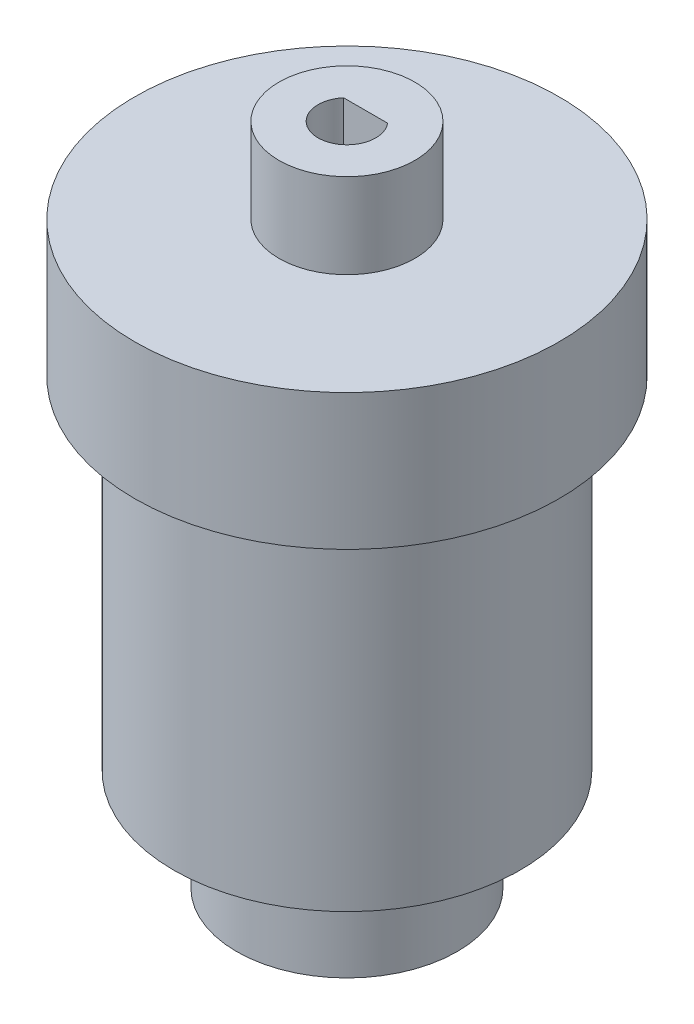
ISO-10303-21;
HEADER;
FILE_DESCRIPTION(('STEP AP214'),'2;1');
FILE_NAME('part.step','',(''),(''),'','','');
FILE_SCHEMA(('AUTOMOTIVE_DESIGN { 1 0 10303 214 1 1 1 1 }'));
ENDSEC;
DATA;
#1=APPLICATION_CONTEXT('core data for automotive mechanical design processes');
#2=APPLICATION_PROTOCOL_DEFINITION('international standard','automotive_design',2000,#1);
#3=PRODUCT_CONTEXT('',#1,'mechanical');
#4=PRODUCT('Part','Part','',(#3));
#5=PRODUCT_RELATED_PRODUCT_CATEGORY('part','',(#4));
#6=PRODUCT_DEFINITION_FORMATION('','',#4);
#7=PRODUCT_DEFINITION_CONTEXT('part definition',#1,'design');
#8=PRODUCT_DEFINITION('design','',#6,#7);
#9=PRODUCT_DEFINITION_SHAPE('','',#8);
#10=(LENGTH_UNIT() NAMED_UNIT(*) SI_UNIT(.MILLI.,.METRE.));
#11=(NAMED_UNIT(*) PLANE_ANGLE_UNIT() SI_UNIT($,.RADIAN.));
#12=(NAMED_UNIT(*) SI_UNIT($,.STERADIAN.) SOLID_ANGLE_UNIT());
#13=UNCERTAINTY_MEASURE_WITH_UNIT(LENGTH_MEASURE(1.E-05),#10,'distance_accuracy_value','');
#14=(GEOMETRIC_REPRESENTATION_CONTEXT(3) GLOBAL_UNCERTAINTY_ASSIGNED_CONTEXT((#13)) GLOBAL_UNIT_ASSIGNED_CONTEXT((#10,
#11,#12)) REPRESENTATION_CONTEXT('',''));
#15=CARTESIAN_POINT('',(0.,0.,0.));
#16=DIRECTION('',(0.,0.,1.));
#17=DIRECTION('',(1.,0.,0.));
#18=AXIS2_PLACEMENT_3D('',#15,#16,#17);
#19=CARTESIAN_POINT('',(0.,20.1,0.));
#20=DIRECTION('',(0.,-1.,0.));
#21=DIRECTION('',(0.,0.,-1.));
#22=AXIS2_PLACEMENT_3D('',#19,#20,#21);
#23=CYLINDRICAL_SURFACE('',#22,10.2);
#24=CARTESIAN_POINT('',(0.,20.1,0.));
#25=DIRECTION('',(0.,1.,0.));
#26=DIRECTION('',(0.,0.,1.));
#27=AXIS2_PLACEMENT_3D('',#24,#25,#26);
#28=CIRCLE('',#27,10.2);
#29=CARTESIAN_POINT('',(-5.03591292971732,20.1,-8.87015112409624));
#30=VERTEX_POINT('',#29);
#31=CARTESIAN_POINT('',(5.03591292971732,20.1,-8.87015112409624));
#32=VERTEX_POINT('',#31);
#33=EDGE_CURVE('E115',#30,#32,#28,.T.);
#34=ORIENTED_EDGE('',*,*,#33,.F.);
#35=DIRECTION('',(0.,1.,0.));
#36=VECTOR('',#35,1.);
#37=CARTESIAN_POINT('',(-5.03591292971732,0.,-8.87015112409624));
#38=LINE('',#37,#36);
#39=CARTESIAN_POINT('',(-5.03591292971732,0.,-8.87015112409624));
#40=VERTEX_POINT('',#39);
#41=EDGE_CURVE('E138',#40,#30,#38,.T.);
#42=ORIENTED_EDGE('',*,*,#41,.F.);
#43=CARTESIAN_POINT('',(0.,0.,0.));
#44=DIRECTION('',(0.,1.,0.));
#45=DIRECTION('',(0.,0.,1.));
#46=AXIS2_PLACEMENT_3D('',#43,#44,#45);
#47=CIRCLE('',#46,10.2);
#48=CARTESIAN_POINT('',(5.03591292971732,0.,-8.87015112409624));
#49=VERTEX_POINT('',#48);
#50=EDGE_CURVE('E36',#40,#49,#47,.T.);
#51=ORIENTED_EDGE('',*,*,#50,.T.);
#52=DIRECTION('',(0.,1.,0.));
#53=VECTOR('',#52,1.);
#54=CARTESIAN_POINT('',(5.03591292971732,0.,-8.87015112409624));
#55=LINE('',#54,#53);
#56=EDGE_CURVE('E141',#49,#32,#55,.T.);
#57=ORIENTED_EDGE('',*,*,#56,.T.);
#58=EDGE_LOOP('',(#34,#42,#51,#57));
#59=FACE_BOUND('',#58,.T.);
#60=ADVANCED_FACE('F33',(#59),#23,.T.);
#61=CARTESIAN_POINT('',(0.,0.,0.));
#62=DIRECTION('',(0.,1.,0.));
#63=DIRECTION('',(0.,0.,1.));
#64=AXIS2_PLACEMENT_3D('',#61,#62,#63);
#65=PLANE('',#64);
#66=CARTESIAN_POINT('',(0.,0.,0.));
#67=DIRECTION('',(0.,-1.,0.));
#68=DIRECTION('',(0.,0.,-1.));
#69=AXIS2_PLACEMENT_3D('',#66,#67,#68);
#70=CIRCLE('',#69,6.5);
#71=CARTESIAN_POINT('',(0.,0.,-6.5));
#72=VERTEX_POINT('',#71);
#73=EDGE_CURVE('E11',#72,#72,#70,.T.);
#74=ORIENTED_EDGE('',*,*,#73,.F.);
#75=EDGE_LOOP('',(#74));
#76=FACE_BOUND('',#75,.T.);
#77=ORIENTED_EDGE('',*,*,#50,.F.);
#78=DIRECTION('',(0.581861504610038,0.,0.813287888421402));
#79=VECTOR('',#78,1.);
#80=CARTESIAN_POINT('',(-3.6,0.,-6.86312610987151));
#81=LINE('',#80,#79);
#82=CARTESIAN_POINT('',(-3.6,0.,-6.86312610987151));
#83=VERTEX_POINT('',#82);
#84=EDGE_CURVE('E122',#40,#83,#81,.T.);
#85=ORIENTED_EDGE('',*,*,#84,.T.);
#86=DIRECTION('',(1.,0.,0.));
#87=VECTOR('',#86,1.);
#88=CARTESIAN_POINT('',(-3.6,0.,-6.86312610987151));
#89=LINE('',#88,#87);
#90=CARTESIAN_POINT('',(3.6,0.,-6.86312610987151));
#91=VERTEX_POINT('',#90);
#92=EDGE_CURVE('E125',#83,#91,#89,.T.);
#93=ORIENTED_EDGE('',*,*,#92,.T.);
#94=DIRECTION('',(0.581861504610037,0.,-0.813287888421402));
#95=VECTOR('',#94,1.);
#96=CARTESIAN_POINT('',(3.6,0.,-6.86312610987151));
#97=LINE('',#96,#95);
#98=EDGE_CURVE('E57',#91,#49,#97,.T.);
#99=ORIENTED_EDGE('',*,*,#98,.T.);
#100=EDGE_LOOP('',(#77,#85,#93,#99));
#101=FACE_BOUND('',#100,.T.);
#102=ADVANCED_FACE('F154',(#76,#101),#65,.F.);
#103=CARTESIAN_POINT('',(-3.6,0.,-6.86312610987151));
#104=DIRECTION('',(-0.813287888421402,0.,0.581861504610038));
#105=DIRECTION('',(0.581861504610038,0.,0.813287888421402));
#106=AXIS2_PLACEMENT_3D('',#103,#104,#105);
#107=PLANE('',#106);
#108=DIRECTION('',(0.581861504610038,0.,0.813287888421402));
#109=VECTOR('',#108,1.);
#110=CARTESIAN_POINT('',(-3.6,20.1,-6.86312610987151));
#111=LINE('',#110,#109);
#112=CARTESIAN_POINT('',(-3.6,20.1,-6.86312610987151));
#113=VERTEX_POINT('',#112);
#114=EDGE_CURVE('E119',#30,#113,#111,.T.);
#115=ORIENTED_EDGE('',*,*,#114,.T.);
#116=DIRECTION('',(0.,1.,0.));
#117=VECTOR('',#116,1.);
#118=CARTESIAN_POINT('',(-3.6,0.,-6.86312610987151));
#119=LINE('',#118,#117);
#120=EDGE_CURVE('E130',#83,#113,#119,.T.);
#121=ORIENTED_EDGE('',*,*,#120,.F.);
#122=ORIENTED_EDGE('',*,*,#84,.F.);
#123=ORIENTED_EDGE('',*,*,#41,.T.);
#124=EDGE_LOOP('',(#115,#121,#122,#123));
#125=FACE_BOUND('',#124,.T.);
#126=ADVANCED_FACE('F162',(#125),#107,.F.);
#127=CARTESIAN_POINT('',(3.6,0.,-6.86312610987151));
#128=DIRECTION('',(0.813287888421402,0.,0.581861504610037));
#129=DIRECTION('',(0.581861504610037,0.,-0.813287888421402));
#130=AXIS2_PLACEMENT_3D('',#127,#128,#129);
#131=PLANE('',#130);
#132=DIRECTION('',(0.581861504610037,0.,-0.813287888421402));
#133=VECTOR('',#132,1.);
#134=CARTESIAN_POINT('',(3.6,20.1,-6.86312610987151));
#135=LINE('',#134,#133);
#136=CARTESIAN_POINT('',(3.6,20.1,-6.86312610987151));
#137=VERTEX_POINT('',#136);
#138=EDGE_CURVE('E126',#137,#32,#135,.T.);
#139=ORIENTED_EDGE('',*,*,#138,.T.);
#140=ORIENTED_EDGE('',*,*,#56,.F.);
#141=ORIENTED_EDGE('',*,*,#98,.F.);
#142=DIRECTION('',(0.,1.,0.));
#143=VECTOR('',#142,1.);
#144=CARTESIAN_POINT('',(3.6,0.,-6.86312610987151));
#145=LINE('',#144,#143);
#146=EDGE_CURVE('E144',#91,#137,#145,.T.);
#147=ORIENTED_EDGE('',*,*,#146,.T.);
#148=EDGE_LOOP('',(#139,#140,#141,#147));
#149=FACE_BOUND('',#148,.T.);
#150=ADVANCED_FACE('F158',(#149),#131,.F.);
#151=CARTESIAN_POINT('',(-3.6,0.,-6.86312610987151));
#152=DIRECTION('',(0.,0.,1.));
#153=DIRECTION('',(1.,0.,0.));
#154=AXIS2_PLACEMENT_3D('',#151,#152,#153);
#155=PLANE('',#154);
#156=DIRECTION('',(1.,0.,0.));
#157=VECTOR('',#156,1.);
#158=CARTESIAN_POINT('',(-3.6,20.1,-6.86312610987151));
#159=LINE('',#158,#157);
#160=EDGE_CURVE('E133',#113,#137,#159,.T.);
#161=ORIENTED_EDGE('',*,*,#160,.T.);
#162=ORIENTED_EDGE('',*,*,#146,.F.);
#163=ORIENTED_EDGE('',*,*,#92,.F.);
#164=ORIENTED_EDGE('',*,*,#120,.T.);
#165=EDGE_LOOP('',(#161,#162,#163,#164));
#166=FACE_BOUND('',#165,.T.);
#167=ADVANCED_FACE('F157',(#166),#155,.F.);
#168=CARTESIAN_POINT('',(0.,28.1,0.));
#169=DIRECTION('',(0.,-1.,0.));
#170=DIRECTION('',(0.,0.,-1.));
#171=AXIS2_PLACEMENT_3D('',#168,#169,#170);
#172=CYLINDRICAL_SURFACE('',#171,12.5);
#173=CARTESIAN_POINT('',(0.,28.1,0.));
#174=DIRECTION('',(0.,1.,0.));
#175=DIRECTION('',(0.,0.,1.));
#176=AXIS2_PLACEMENT_3D('',#173,#174,#175);
#177=CIRCLE('',#176,12.5);
#178=CARTESIAN_POINT('',(0.,28.1,12.5));
#179=VERTEX_POINT('',#178);
#180=EDGE_CURVE('E116',#179,#179,#177,.T.);
#181=ORIENTED_EDGE('',*,*,#180,.F.);
#182=EDGE_LOOP('',(#181));
#183=FACE_BOUND('',#182,.T.);
#184=CARTESIAN_POINT('',(0.,20.1,0.));
#185=DIRECTION('',(0.,1.,0.));
#186=DIRECTION('',(0.,0.,1.));
#187=AXIS2_PLACEMENT_3D('',#184,#185,#186);
#188=CIRCLE('',#187,12.5);
#189=CARTESIAN_POINT('',(0.,20.1,12.5));
#190=VERTEX_POINT('',#189);
#191=EDGE_CURVE('E112',#190,#190,#188,.T.);
#192=ORIENTED_EDGE('',*,*,#191,.T.);
#193=EDGE_LOOP('',(#192));
#194=FACE_BOUND('',#193,.T.);
#195=ADVANCED_FACE('F227',(#183,#194),#172,.T.);
#196=CARTESIAN_POINT('',(0.,28.1,0.));
#197=DIRECTION('',(0.,1.,0.));
#198=DIRECTION('',(0.,0.,1.));
#199=AXIS2_PLACEMENT_3D('',#196,#197,#198);
#200=PLANE('',#199);
#201=CARTESIAN_POINT('',(0.,28.1,0.));
#202=DIRECTION('',(0.,1.,0.));
#203=DIRECTION('',(0.,0.,1.));
#204=AXIS2_PLACEMENT_3D('',#201,#202,#203);
#205=CIRCLE('',#204,4.);
#206=CARTESIAN_POINT('',(0.,28.1,4.));
#207=VERTEX_POINT('',#206);
#208=EDGE_CURVE('E41',#207,#207,#205,.T.);
#209=ORIENTED_EDGE('',*,*,#208,.F.);
#210=EDGE_LOOP('',(#209));
#211=FACE_BOUND('',#210,.T.);
#212=ORIENTED_EDGE('',*,*,#180,.T.);
#213=EDGE_LOOP('',(#212));
#214=FACE_BOUND('',#213,.T.);
#215=ADVANCED_FACE('F224',(#211,#214),#200,.T.);
#216=CARTESIAN_POINT('',(0.,20.1,0.));
#217=DIRECTION('',(0.,1.,0.));
#218=DIRECTION('',(0.,0.,1.));
#219=AXIS2_PLACEMENT_3D('',#216,#217,#218);
#220=PLANE('',#219);
#221=ORIENTED_EDGE('',*,*,#114,.F.);
#222=ORIENTED_EDGE('',*,*,#33,.T.);
#223=ORIENTED_EDGE('',*,*,#138,.F.);
#224=ORIENTED_EDGE('',*,*,#160,.F.);
#225=EDGE_LOOP('',(#221,#222,#223,#224));
#226=FACE_BOUND('',#225,.T.);
#227=ORIENTED_EDGE('',*,*,#191,.F.);
#228=EDGE_LOOP('',(#227));
#229=FACE_BOUND('',#228,.T.);
#230=ADVANCED_FACE('F159',(#226,#229),#220,.F.);
#231=CARTESIAN_POINT('',(0.,33.1,0.));
#232=DIRECTION('',(0.,-1.,0.));
#233=DIRECTION('',(0.,0.,-1.));
#234=AXIS2_PLACEMENT_3D('',#231,#232,#233);
#235=CYLINDRICAL_SURFACE('',#234,4.);
#236=CARTESIAN_POINT('',(0.,33.1,0.));
#237=DIRECTION('',(0.,1.,0.));
#238=DIRECTION('',(0.,0.,1.));
#239=AXIS2_PLACEMENT_3D('',#236,#237,#238);
#240=CIRCLE('',#239,4.);
#241=CARTESIAN_POINT('',(0.,33.1,4.));
#242=VERTEX_POINT('',#241);
#243=EDGE_CURVE('E108',#242,#242,#240,.T.);
#244=ORIENTED_EDGE('',*,*,#243,.F.);
#245=EDGE_LOOP('',(#244));
#246=FACE_BOUND('',#245,.T.);
#247=ORIENTED_EDGE('',*,*,#208,.T.);
#248=EDGE_LOOP('',(#247));
#249=FACE_BOUND('',#248,.T.);
#250=ADVANCED_FACE('F219',(#246,#249),#235,.T.);
#251=CARTESIAN_POINT('',(0.,33.1,0.));
#252=DIRECTION('',(0.,1.,0.));
#253=DIRECTION('',(0.,0.,1.));
#254=AXIS2_PLACEMENT_3D('',#251,#252,#253);
#255=PLANE('',#254);
#256=CARTESIAN_POINT('',(0.,33.1,0.));
#257=DIRECTION('',(0.,1.,0.));
#258=DIRECTION('',(0.,0.,1.));
#259=AXIS2_PLACEMENT_3D('',#256,#257,#258);
#260=CIRCLE('',#259,1.7);
#261=CARTESIAN_POINT('',(-1.29614813968157,33.1,-1.1));
#262=VERTEX_POINT('',#261);
#263=CARTESIAN_POINT('',(1.29614813968157,33.1,-1.1));
#264=VERTEX_POINT('',#263);
#265=EDGE_CURVE('E49',#262,#264,#260,.T.);
#266=ORIENTED_EDGE('',*,*,#265,.F.);
#267=DIRECTION('',(-1.,0.,0.));
#268=VECTOR('',#267,1.);
#269=CARTESIAN_POINT('',(-1.29614813968157,33.1,-1.1));
#270=LINE('',#269,#268);
#271=EDGE_CURVE('E100',#264,#262,#270,.T.);
#272=ORIENTED_EDGE('',*,*,#271,.F.);
#273=EDGE_LOOP('',(#266,#272));
#274=FACE_BOUND('',#273,.T.);
#275=ORIENTED_EDGE('',*,*,#243,.T.);
#276=EDGE_LOOP('',(#275));
#277=FACE_BOUND('',#276,.T.);
#278=ADVANCED_FACE('F216',(#274,#277),#255,.T.);
#279=CARTESIAN_POINT('',(0.,18.1,0.));
#280=DIRECTION('',(0.,1.,0.));
#281=DIRECTION('',(0.,0.,1.));
#282=AXIS2_PLACEMENT_3D('',#279,#280,#281);
#283=CYLINDRICAL_SURFACE('',#282,1.7);
#284=ORIENTED_EDGE('',*,*,#265,.T.);
#285=DIRECTION('',(0.,1.,0.));
#286=VECTOR('',#285,1.);
#287=CARTESIAN_POINT('',(1.29614813968157,18.1,-1.1));
#288=LINE('',#287,#286);
#289=CARTESIAN_POINT('',(1.29614813968157,18.1,-1.1));
#290=VERTEX_POINT('',#289);
#291=EDGE_CURVE('E86',#290,#264,#288,.T.);
#292=ORIENTED_EDGE('',*,*,#291,.F.);
#293=CARTESIAN_POINT('',(0.,18.1,0.));
#294=DIRECTION('',(0.,1.,0.));
#295=DIRECTION('',(0.,0.,1.));
#296=AXIS2_PLACEMENT_3D('',#293,#294,#295);
#297=CIRCLE('',#296,1.7);
#298=CARTESIAN_POINT('',(-1.29614813968157,18.1,-1.1));
#299=VERTEX_POINT('',#298);
#300=EDGE_CURVE('E89',#299,#290,#297,.T.);
#301=ORIENTED_EDGE('',*,*,#300,.F.);
#302=DIRECTION('',(0.,1.,0.));
#303=VECTOR('',#302,1.);
#304=CARTESIAN_POINT('',(-1.29614813968157,18.1,-1.1));
#305=LINE('',#304,#303);
#306=EDGE_CURVE('E95',#299,#262,#305,.T.);
#307=ORIENTED_EDGE('',*,*,#306,.T.);
#308=EDGE_LOOP('',(#284,#292,#301,#307));
#309=FACE_BOUND('',#308,.T.);
#310=ADVANCED_FACE('F88',(#309),#283,.F.);
#311=CARTESIAN_POINT('',(-1.29614813968157,18.1,-1.1));
#312=DIRECTION('',(0.,0.,-1.));
#313=DIRECTION('',(-1.,0.,0.));
#314=AXIS2_PLACEMENT_3D('',#311,#312,#313);
#315=PLANE('',#314);
#316=ORIENTED_EDGE('',*,*,#271,.T.);
#317=ORIENTED_EDGE('',*,*,#306,.F.);
#318=DIRECTION('',(-1.,0.,0.));
#319=VECTOR('',#318,1.);
#320=CARTESIAN_POINT('',(-1.29614813968157,18.1,-1.1));
#321=LINE('',#320,#319);
#322=EDGE_CURVE('E96',#290,#299,#321,.T.);
#323=ORIENTED_EDGE('',*,*,#322,.F.);
#324=ORIENTED_EDGE('',*,*,#291,.T.);
#325=EDGE_LOOP('',(#316,#317,#323,#324));
#326=FACE_BOUND('',#325,.T.);
#327=ADVANCED_FACE('F102',(#326),#315,.F.);
#328=CARTESIAN_POINT('',(0.,18.1,0.));
#329=DIRECTION('',(0.,1.,0.));
#330=DIRECTION('',(0.,0.,1.));
#331=AXIS2_PLACEMENT_3D('',#328,#329,#330);
#332=PLANE('',#331);
#333=ORIENTED_EDGE('',*,*,#300,.T.);
#334=ORIENTED_EDGE('',*,*,#322,.T.);
#335=EDGE_LOOP('',(#333,#334));
#336=FACE_BOUND('',#335,.T.);
#337=ADVANCED_FACE('F99',(#336),#332,.T.);
#338=CARTESIAN_POINT('',(0.,-6.,0.));
#339=DIRECTION('',(0.,1.,0.));
#340=DIRECTION('',(0.,0.,1.));
#341=AXIS2_PLACEMENT_3D('',#338,#339,#340);
#342=CYLINDRICAL_SURFACE('',#341,6.5);
#343=CARTESIAN_POINT('',(0.,-6.,0.));
#344=DIRECTION('',(0.,-1.,0.));
#345=DIRECTION('',(0.,0.,-1.));
#346=AXIS2_PLACEMENT_3D('',#343,#344,#345);
#347=CIRCLE('',#346,6.5);
#348=CARTESIAN_POINT('',(0.,-6.,-6.5));
#349=VERTEX_POINT('',#348);
#350=EDGE_CURVE('E106',#349,#349,#347,.T.);
#351=ORIENTED_EDGE('',*,*,#350,.F.);
#352=EDGE_LOOP('',(#351));
#353=FACE_BOUND('',#352,.T.);
#354=ORIENTED_EDGE('',*,*,#73,.T.);
#355=EDGE_LOOP('',(#354));
#356=FACE_BOUND('',#355,.T.);
#357=ADVANCED_FACE('F190',(#353,#356),#342,.T.);
#358=CARTESIAN_POINT('',(0.,-6.,0.));
#359=DIRECTION('',(0.,-1.,0.));
#360=DIRECTION('',(0.,0.,-1.));
#361=AXIS2_PLACEMENT_3D('',#358,#359,#360);
#362=PLANE('',#361);
#363=ORIENTED_EDGE('',*,*,#350,.T.);
#364=EDGE_LOOP('',(#363));
#365=FACE_BOUND('',#364,.T.);
#366=ADVANCED_FACE('F195',(#365),#362,.T.);
#367=CLOSED_SHELL('',(#60,#102,#126,#150,#167,#195,#215,#230,#250,#278,#310,#327,#337,#357,#366));
#368=MANIFOLD_SOLID_BREP('B2',#367);
#369=ADVANCED_BREP_SHAPE_REPRESENTATION('',(#18,#368),#14);
#370=SHAPE_DEFINITION_REPRESENTATION(#9,#369);
ENDSEC;
END-ISO-10303-21;
